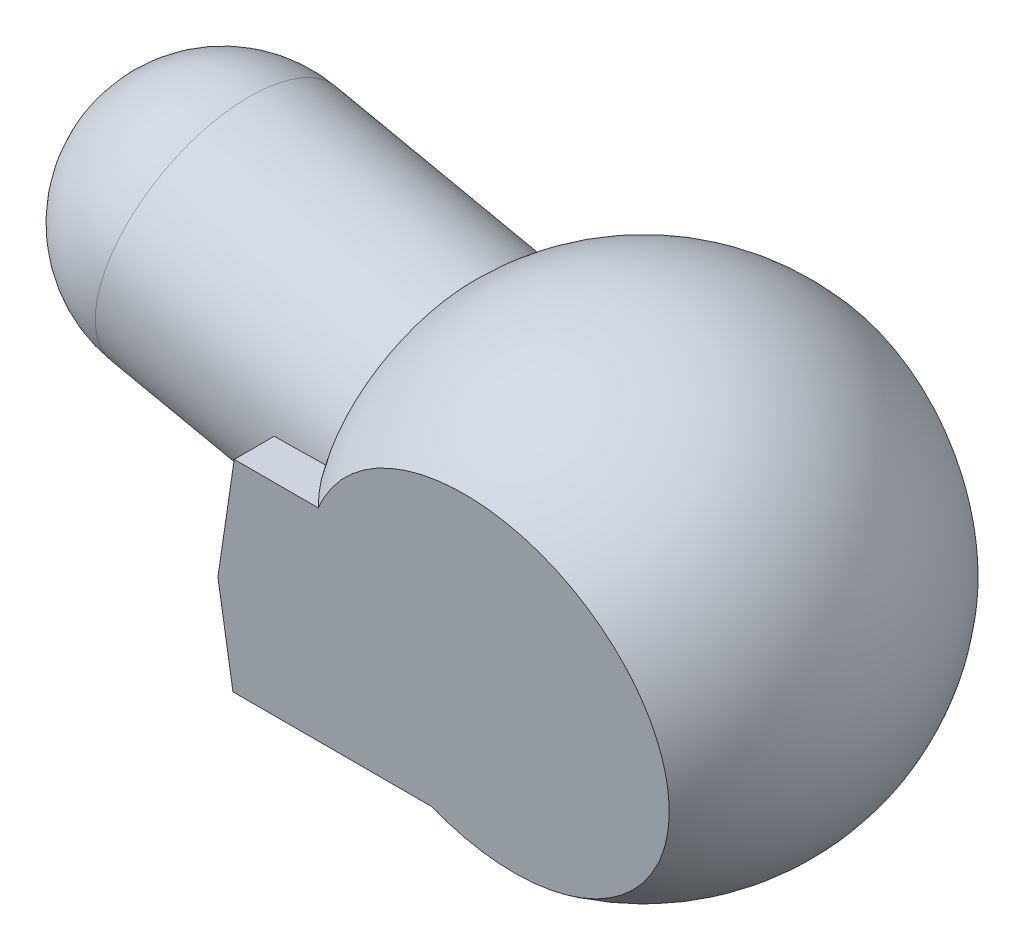
ISO-10303-21;
HEADER;
FILE_DESCRIPTION(('STEP AP214'),'2;1');
FILE_NAME('part.step','',(''),(''),'','','');
FILE_SCHEMA(('AUTOMOTIVE_DESIGN { 1 0 10303 214 1 1 1 1 }'));
ENDSEC;
DATA;
#1=APPLICATION_CONTEXT('core data for automotive mechanical design processes');
#2=APPLICATION_PROTOCOL_DEFINITION('international standard','automotive_design',2000,#1);
#3=PRODUCT_CONTEXT('',#1,'mechanical');
#4=PRODUCT('Part','Part','',(#3));
#5=PRODUCT_RELATED_PRODUCT_CATEGORY('part','',(#4));
#6=PRODUCT_DEFINITION_FORMATION('','',#4);
#7=PRODUCT_DEFINITION_CONTEXT('part definition',#1,'design');
#8=PRODUCT_DEFINITION('design','',#6,#7);
#9=PRODUCT_DEFINITION_SHAPE('','',#8);
#10=(LENGTH_UNIT() NAMED_UNIT(*) SI_UNIT(.MILLI.,.METRE.));
#11=(NAMED_UNIT(*) PLANE_ANGLE_UNIT() SI_UNIT($,.RADIAN.));
#12=(NAMED_UNIT(*) SI_UNIT($,.STERADIAN.) SOLID_ANGLE_UNIT());
#13=UNCERTAINTY_MEASURE_WITH_UNIT(LENGTH_MEASURE(1.E-05),#10,'distance_accuracy_value','');
#14=(GEOMETRIC_REPRESENTATION_CONTEXT(3) GLOBAL_UNCERTAINTY_ASSIGNED_CONTEXT((#13)) GLOBAL_UNIT_ASSIGNED_CONTEXT((#10,
#11,#12)) REPRESENTATION_CONTEXT('',''));
#15=CARTESIAN_POINT('',(0.,0.,0.));
#16=DIRECTION('',(0.,0.,1.));
#17=DIRECTION('',(1.,0.,0.));
#18=AXIS2_PLACEMENT_3D('',#15,#16,#17);
#19=CARTESIAN_POINT('',(-127.,25.4,75.3842872801489));
#20=DIRECTION('',(0.,1.,0.));
#21=DIRECTION('',(0.,0.,1.));
#22=AXIS2_PLACEMENT_3D('',#19,#20,#21);
#23=PLANE('',#22);
#24=CARTESIAN_POINT('',(-119.497604780753,25.4,0.));
#25=DIRECTION('',(0.,1.,0.));
#26=DIRECTION('',(1.,0.,0.));
#27=AXIS2_PLACEMENT_3D('',#24,#25,#26);
#28=ELLIPSE('',#27,274.876317802127,57.15);
#29=CARTESIAN_POINT('',(-88.2280398022466,25.4,-56.779005738505));
#30=VERTEX_POINT('',#29);
#31=CARTESIAN_POINT('',(-111.346408178174,25.4,-57.1248666815656));
#32=VERTEX_POINT('',#31);
#33=EDGE_CURVE('E59',#30,#32,#28,.T.);
#34=ORIENTED_EDGE('',*,*,#33,.F.);
#35=CARTESIAN_POINT('',(0.,25.4,0.));
#36=DIRECTION('',(0.,1.,0.));
#37=DIRECTION('',(0.,0.,1.));
#38=AXIS2_PLACEMENT_3D('',#35,#36,#37);
#39=CIRCLE('',#38,104.9192189258);
#40=CARTESIAN_POINT('',(-72.9743224104478,25.4,-75.3842872801489));
#41=VERTEX_POINT('',#40);
#42=EDGE_CURVE('E199',#41,#30,#39,.T.);
#43=ORIENTED_EDGE('',*,*,#42,.F.);
#44=DIRECTION('',(1.,0.,0.));
#45=VECTOR('',#44,1.);
#46=CARTESIAN_POINT('',(-127.,25.4,-75.3842872801489));
#47=LINE('',#46,#45);
#48=CARTESIAN_POINT('',(-111.346408178174,25.4,-75.3842872801489));
#49=VERTEX_POINT('',#48);
#50=EDGE_CURVE('E188',#49,#41,#47,.T.);
#51=ORIENTED_EDGE('',*,*,#50,.F.);
#52=DIRECTION('',(0.,0.,1.));
#53=VECTOR('',#52,1.);
#54=CARTESIAN_POINT('',(-111.346408178174,25.4,75.3842872801489));
#55=LINE('',#54,#53);
#56=EDGE_CURVE('E212',#49,#32,#55,.T.);
#57=ORIENTED_EDGE('',*,*,#56,.T.);
#58=EDGE_LOOP('',(#34,#43,#51,#57));
#59=FACE_BOUND('',#58,.T.);
#60=ADVANCED_FACE('F36',(#59),#23,.T.);
#61=CARTESIAN_POINT('',(-127.,25.4,75.3842872801489));
#62=DIRECTION('',(0.,-0.139173100960066,0.99026806874157));
#63=DIRECTION('',(0.,-0.99026806874157,-0.139173100960066));
#64=AXIS2_PLACEMENT_3D('',#61,#62,#63);
#65=PLANE('',#64);
#66=DIRECTION('',(1.,0.,0.));
#67=VECTOR('',#66,1.);
#68=CARTESIAN_POINT('',(-127.,25.4,75.3842872801489));
#69=LINE('',#68,#67);
#70=CARTESIAN_POINT('',(-111.346408178174,25.4,75.3842872801489));
#71=VERTEX_POINT('',#70);
#72=CARTESIAN_POINT('',(-72.9743224104478,25.4,75.3842872801489));
#73=VERTEX_POINT('',#72);
#74=EDGE_CURVE('E184',#71,#73,#69,.T.);
#75=ORIENTED_EDGE('',*,*,#74,.F.);
#76=DIRECTION('',(-0.256466671058071,-0.957146646836786,-0.134518188679037));
#77=VECTOR('',#76,1.);
#78=CARTESIAN_POINT('',(-112.376025580946,21.5574155404979,74.844247252796));
#79=LINE('',#78,#77);
#80=CARTESIAN_POINT('',(-127.,-33.0200000000007,67.173891716835));
#81=VERTEX_POINT('',#80);
#82=EDGE_CURVE('E214',#71,#81,#79,.T.);
#83=ORIENTED_EDGE('',*,*,#82,.T.);
#84=DIRECTION('',(0.,-0.99026806874157,-0.139173100960066));
#85=VECTOR('',#84,1.);
#86=CARTESIAN_POINT('',(-127.,25.4,75.3842872801489));
#87=LINE('',#86,#85);
#88=CARTESIAN_POINT('',(-127.,-81.7523967538567,60.325));
#89=VERTEX_POINT('',#88);
#90=EDGE_CURVE('E175',#81,#89,#87,.T.);
#91=ORIENTED_EDGE('',*,*,#90,.T.);
#92=DIRECTION('',(1.,0.,0.));
#93=VECTOR('',#92,1.);
#94=CARTESIAN_POINT('',(-127.,-81.7523967538567,60.325));
#95=LINE('',#94,#93);
#96=CARTESIAN_POINT('',(-36.4779728055165,-81.7523967538567,60.325));
#97=VERTEX_POINT('',#96);
#98=EDGE_CURVE('E183',#89,#97,#95,.T.);
#99=ORIENTED_EDGE('',*,*,#98,.T.);
#100=CARTESIAN_POINT('',(0.,-9.8973863464413,70.4235631402072));
#101=DIRECTION('',(0.,0.139173100960066,-0.99026806874157));
#102=DIRECTION('',(0.,0.99026806874157,0.139173100960066));
#103=AXIS2_PLACEMENT_3D('',#100,#101,#102);
#104=CIRCLE('',#103,81.2143213857416);
#105=EDGE_CURVE('E140',#73,#97,#104,.T.);
#106=ORIENTED_EDGE('',*,*,#105,.F.);
#107=EDGE_LOOP('',(#75,#83,#91,#99,#106));
#108=FACE_BOUND('',#107,.T.);
#109=ADVANCED_FACE('F240',(#108),#65,.T.);
#110=CARTESIAN_POINT('',(-111.346408178174,25.4,57.1248666815657));
#111=VERTEX_POINT('',#110);
#112=CARTESIAN_POINT('',(-88.2280398022466,25.4,56.779005738505));
#113=VERTEX_POINT('',#112);
#114=EDGE_CURVE('E144',#111,#113,#28,.T.);
#115=ORIENTED_EDGE('',*,*,#114,.F.);
#116=EDGE_CURVE('E211',#111,#71,#55,.T.);
#117=ORIENTED_EDGE('',*,*,#116,.T.);
#118=ORIENTED_EDGE('',*,*,#74,.T.);
#119=EDGE_CURVE('E198',#113,#73,#39,.T.);
#120=ORIENTED_EDGE('',*,*,#119,.F.);
#121=EDGE_LOOP('',(#115,#117,#118,#120));
#122=FACE_BOUND('',#121,.T.);
#123=ADVANCED_FACE('F229',(#122),#23,.T.);
#124=CARTESIAN_POINT('',(-127.,25.4,-75.3842872801489));
#125=DIRECTION('',(0.,-0.139173100960066,-0.99026806874157));
#126=DIRECTION('',(0.,0.99026806874157,-0.139173100960066));
#127=AXIS2_PLACEMENT_3D('',#124,#125,#126);
#128=PLANE('',#127);
#129=DIRECTION('',(0.,0.99026806874157,-0.139173100960066));
#130=VECTOR('',#129,1.);
#131=CARTESIAN_POINT('',(-127.,25.4,-75.3842872801489));
#132=LINE('',#131,#130);
#133=CARTESIAN_POINT('',(-127.,-81.7523967538567,-60.325));
#134=VERTEX_POINT('',#133);
#135=CARTESIAN_POINT('',(-127.,-33.0200000000007,-67.173891716835));
#136=VERTEX_POINT('',#135);
#137=EDGE_CURVE('E180',#134,#136,#132,.T.);
#138=ORIENTED_EDGE('',*,*,#137,.T.);
#139=DIRECTION('',(0.256466671058071,0.957146646836786,-0.134518188679037));
#140=VECTOR('',#139,1.);
#141=CARTESIAN_POINT('',(-112.376025580946,21.5574155404979,-74.844247252796));
#142=LINE('',#141,#140);
#143=EDGE_CURVE('E44',#136,#49,#142,.T.);
#144=ORIENTED_EDGE('',*,*,#143,.T.);
#145=ORIENTED_EDGE('',*,*,#50,.T.);
#146=CARTESIAN_POINT('',(0.,-9.8973863464413,-70.4235631402072));
#147=DIRECTION('',(0.,0.139173100960066,0.99026806874157));
#148=DIRECTION('',(0.,-0.99026806874157,0.139173100960066));
#149=AXIS2_PLACEMENT_3D('',#146,#147,#148);
#150=CIRCLE('',#149,81.2143213857416);
#151=CARTESIAN_POINT('',(-36.4779728055165,-81.7523967538567,-60.325));
#152=VERTEX_POINT('',#151);
#153=EDGE_CURVE('E138',#152,#41,#150,.T.);
#154=ORIENTED_EDGE('',*,*,#153,.F.);
#155=DIRECTION('',(1.,0.,0.));
#156=VECTOR('',#155,1.);
#157=CARTESIAN_POINT('',(-127.,-81.7523967538567,-60.325));
#158=LINE('',#157,#156);
#159=EDGE_CURVE('E191',#134,#152,#158,.T.);
#160=ORIENTED_EDGE('',*,*,#159,.F.);
#161=EDGE_LOOP('',(#138,#144,#145,#154,#160));
#162=FACE_BOUND('',#161,.T.);
#163=ADVANCED_FACE('F220',(#162),#128,.T.);
#164=CARTESIAN_POINT('',(-127.,0.,0.));
#165=DIRECTION('',(1.,0.,0.));
#166=DIRECTION('',(0.,0.,-1.));
#167=AXIS2_PLACEMENT_3D('',#164,#165,#166);
#168=CYLINDRICAL_SURFACE('',#167,101.6);
#169=DIRECTION('',(1.,0.,0.));
#170=VECTOR('',#169,1.);
#171=CARTESIAN_POINT('',(-127.,-100.803124951561,-12.7));
#172=LINE('',#171,#170);
#173=CARTESIAN_POINT('',(-50.8,-100.803124951561,-12.7));
#174=VERTEX_POINT('',#173);
#175=CARTESIAN_POINT('',(-36.4779728055165,-100.803124951561,-12.7));
#176=VERTEX_POINT('',#175);
#177=EDGE_CURVE('E172',#174,#176,#172,.T.);
#178=ORIENTED_EDGE('',*,*,#177,.F.);
#179=CARTESIAN_POINT('',(-50.8,0.,0.));
#180=DIRECTION('',(-1.,0.,0.));
#181=DIRECTION('',(0.,0.,1.));
#182=AXIS2_PLACEMENT_3D('',#179,#180,#181);
#183=CIRCLE('',#182,101.6);
#184=CARTESIAN_POINT('',(-50.8,-100.803124951561,12.7));
#185=VERTEX_POINT('',#184);
#186=EDGE_CURVE('E208',#185,#174,#183,.F.);
#187=ORIENTED_EDGE('',*,*,#186,.F.);
#188=DIRECTION('',(1.,0.,0.));
#189=VECTOR('',#188,1.);
#190=CARTESIAN_POINT('',(-127.,-100.803124951561,12.7));
#191=LINE('',#190,#189);
#192=CARTESIAN_POINT('',(-36.4779728055165,-100.803124951561,12.7));
#193=VERTEX_POINT('',#192);
#194=EDGE_CURVE('E167',#185,#193,#191,.T.);
#195=ORIENTED_EDGE('',*,*,#194,.T.);
#196=CARTESIAN_POINT('',(-36.4779728055165,0.,0.));
#197=DIRECTION('',(1.,0.,0.));
#198=DIRECTION('',(0.,0.,-1.));
#199=AXIS2_PLACEMENT_3D('',#196,#197,#198);
#200=CIRCLE('',#199,101.6);
#201=EDGE_CURVE('E196',#97,#193,#200,.T.);
#202=ORIENTED_EDGE('',*,*,#201,.F.);
#203=ORIENTED_EDGE('',*,*,#98,.F.);
#204=CARTESIAN_POINT('',(-127.,0.,0.));
#205=DIRECTION('',(1.,0.,0.));
#206=DIRECTION('',(0.,0.,-1.));
#207=AXIS2_PLACEMENT_3D('',#204,#205,#206);
#208=CIRCLE('',#207,101.6);
#209=EDGE_CURVE('E177',#89,#134,#208,.T.);
#210=ORIENTED_EDGE('',*,*,#209,.T.);
#211=ORIENTED_EDGE('',*,*,#159,.T.);
#212=EDGE_CURVE('E187',#176,#152,#200,.T.);
#213=ORIENTED_EDGE('',*,*,#212,.F.);
#214=EDGE_LOOP('',(#178,#187,#195,#202,#203,#210,#211,#213));
#215=FACE_BOUND('',#214,.T.);
#216=ADVANCED_FACE('F237',(#215),#168,.T.);
#217=CARTESIAN_POINT('',(-127.,0.,0.));
#218=DIRECTION('',(1.,0.,0.));
#219=DIRECTION('',(0.,0.,-1.));
#220=AXIS2_PLACEMENT_3D('',#217,#218,#219);
#221=PLANE('',#220);
#222=ORIENTED_EDGE('',*,*,#90,.F.);
#223=DIRECTION('',(0.,0.,-1.));
#224=VECTOR('',#223,1.);
#225=CARTESIAN_POINT('',(-127.,-33.0200000000007,-75.3842872801489));
#226=LINE('',#225,#224);
#227=EDGE_CURVE('E216',#81,#136,#226,.T.);
#228=ORIENTED_EDGE('',*,*,#227,.T.);
#229=ORIENTED_EDGE('',*,*,#137,.F.);
#230=ORIENTED_EDGE('',*,*,#209,.F.);
#231=EDGE_LOOP('',(#222,#228,#229,#230));
#232=FACE_BOUND('',#231,.T.);
#233=ADVANCED_FACE('F243',(#232),#221,.F.);
#234=CARTESIAN_POINT('',(0.,0.,0.));
#235=DIRECTION('',(-1.,0.,0.));
#236=DIRECTION('',(0.,1.,0.));
#237=AXIS2_PLACEMENT_3D('',#234,#235,#236);
#238=SPHERICAL_SURFACE('',#237,107.95);
#239=ORIENTED_EDGE('',*,*,#212,.T.);
#240=ORIENTED_EDGE('',*,*,#153,.T.);
#241=ORIENTED_EDGE('',*,*,#42,.T.);
#242=CARTESIAN_POINT('',(-89.5797377672125,19.0407610551009,0.));
#243=DIRECTION('',(0.978147600733806,-0.20791169081776,0.));
#244=DIRECTION('',(0.20791169081776,0.978147600733806,0.));
#245=AXIS2_PLACEMENT_3D('',#242,#243,#244);
#246=CIRCLE('',#245,57.15);
#247=EDGE_CURVE('E51',#30,#113,#246,.T.);
#248=ORIENTED_EDGE('',*,*,#247,.T.);
#249=ORIENTED_EDGE('',*,*,#119,.T.);
#250=ORIENTED_EDGE('',*,*,#105,.T.);
#251=ORIENTED_EDGE('',*,*,#201,.T.);
#252=CARTESIAN_POINT('',(0.,0.,12.7));
#253=DIRECTION('',(0.,0.,-1.));
#254=DIRECTION('',(-1.,0.,0.));
#255=AXIS2_PLACEMENT_3D('',#252,#253,#254);
#256=CIRCLE('',#255,107.200338152452);
#257=CARTESIAN_POINT('',(-3.17122908317451,-107.153421812381,12.7));
#258=VERTEX_POINT('',#257);
#259=EDGE_CURVE('E201',#258,#193,#256,.T.);
#260=ORIENTED_EDGE('',*,*,#259,.F.);
#261=CARTESIAN_POINT('',(50.292,-67.056,0.));
#262=DIRECTION('',(0.6,-0.8,0.));
#263=DIRECTION('',(0.8,0.6,0.));
#264=AXIS2_PLACEMENT_3D('',#261,#262,#263);
#265=CIRCLE('',#264,68.0250696434777);
#266=CARTESIAN_POINT('',(-3.17122908317453,-107.153421812381,-12.7));
#267=VERTEX_POINT('',#266);
#268=EDGE_CURVE('E204',#258,#267,#265,.T.);
#269=ORIENTED_EDGE('',*,*,#268,.T.);
#270=CARTESIAN_POINT('',(0.,0.,-12.7));
#271=DIRECTION('',(0.,0.,-1.));
#272=DIRECTION('',(-1.,0.,0.));
#273=AXIS2_PLACEMENT_3D('',#270,#271,#272);
#274=CIRCLE('',#273,107.200338152452);
#275=EDGE_CURVE('E206',#267,#176,#274,.T.);
#276=ORIENTED_EDGE('',*,*,#275,.T.);
#277=EDGE_LOOP('',(#239,#240,#241,#248,#249,#250,#251,#260,#269,#276));
#278=FACE_BOUND('',#277,.T.);
#279=ADVANCED_FACE('F232',(#278),#238,.T.);
#280=CARTESIAN_POINT('',(12.7,-95.25,-12.7));
#281=DIRECTION('',(0.6,-0.8,0.));
#282=DIRECTION('',(0.8,0.6,0.));
#283=AXIS2_PLACEMENT_3D('',#280,#281,#282);
#284=PLANE('',#283);
#285=ORIENTED_EDGE('',*,*,#268,.F.);
#286=DIRECTION('',(0.8,0.6,0.));
#287=VECTOR('',#286,1.);
#288=CARTESIAN_POINT('',(12.7,-95.25,12.7));
#289=LINE('',#288,#287);
#290=CARTESIAN_POINT('',(-35.56,-131.445,12.7));
#291=VERTEX_POINT('',#290);
#292=EDGE_CURVE('E152',#291,#258,#289,.T.);
#293=ORIENTED_EDGE('',*,*,#292,.F.);
#294=DIRECTION('',(0.,0.,1.));
#295=VECTOR('',#294,1.);
#296=CARTESIAN_POINT('',(-35.56,-131.445,-12.7));
#297=LINE('',#296,#295);
#298=CARTESIAN_POINT('',(-35.56,-131.445,-12.7));
#299=VERTEX_POINT('',#298);
#300=EDGE_CURVE('E165',#299,#291,#297,.T.);
#301=ORIENTED_EDGE('',*,*,#300,.F.);
#302=DIRECTION('',(0.8,0.6,0.));
#303=VECTOR('',#302,1.);
#304=CARTESIAN_POINT('',(12.7,-95.25,-12.7));
#305=LINE('',#304,#303);
#306=EDGE_CURVE('E155',#299,#267,#305,.T.);
#307=ORIENTED_EDGE('',*,*,#306,.T.);
#308=EDGE_LOOP('',(#285,#293,#301,#307));
#309=FACE_BOUND('',#308,.T.);
#310=ADVANCED_FACE('F253',(#309),#284,.T.);
#311=CARTESIAN_POINT('',(-41.275,-123.825,-12.7));
#312=DIRECTION('',(0.,0.,1.));
#313=DIRECTION('',(1.,0.,0.));
#314=AXIS2_PLACEMENT_3D('',#311,#312,#313);
#315=CYLINDRICAL_SURFACE('',#314,9.525);
#316=CARTESIAN_POINT('',(-41.275,-123.825,12.7));
#317=DIRECTION('',(0.,0.,1.));
#318=DIRECTION('',(-1.,0.,0.));
#319=AXIS2_PLACEMENT_3D('',#316,#317,#318);
#320=CIRCLE('',#319,9.525);
#321=CARTESIAN_POINT('',(-50.8,-123.825,12.7));
#322=VERTEX_POINT('',#321);
#323=EDGE_CURVE('E160',#322,#291,#320,.T.);
#324=ORIENTED_EDGE('',*,*,#323,.F.);
#325=DIRECTION('',(0.,0.,1.));
#326=VECTOR('',#325,1.);
#327=CARTESIAN_POINT('',(-50.8,-123.825,-12.7));
#328=LINE('',#327,#326);
#329=CARTESIAN_POINT('',(-50.8,-123.825,-12.7));
#330=VERTEX_POINT('',#329);
#331=EDGE_CURVE('E158',#330,#322,#328,.T.);
#332=ORIENTED_EDGE('',*,*,#331,.F.);
#333=CARTESIAN_POINT('',(-41.275,-123.825,-12.7));
#334=DIRECTION('',(0.,0.,1.));
#335=DIRECTION('',(-1.,0.,0.));
#336=AXIS2_PLACEMENT_3D('',#333,#334,#335);
#337=CIRCLE('',#336,9.525);
#338=EDGE_CURVE('E151',#330,#299,#337,.T.);
#339=ORIENTED_EDGE('',*,*,#338,.T.);
#340=ORIENTED_EDGE('',*,*,#300,.T.);
#341=EDGE_LOOP('',(#324,#332,#339,#340));
#342=FACE_BOUND('',#341,.T.);
#343=ADVANCED_FACE('F258',(#342),#315,.T.);
#344=CARTESIAN_POINT('',(-50.8,-123.825,-12.7));
#345=DIRECTION('',(-1.,0.,0.));
#346=DIRECTION('',(0.,0.,1.));
#347=AXIS2_PLACEMENT_3D('',#344,#345,#346);
#348=PLANE('',#347);
#349=DIRECTION('',(0.,-1.,0.));
#350=VECTOR('',#349,1.);
#351=CARTESIAN_POINT('',(-50.8,-123.825,12.7));
#352=LINE('',#351,#350);
#353=EDGE_CURVE('E148',#185,#322,#352,.T.);
#354=ORIENTED_EDGE('',*,*,#353,.F.);
#355=ORIENTED_EDGE('',*,*,#186,.T.);
#356=DIRECTION('',(0.,-1.,0.));
#357=VECTOR('',#356,1.);
#358=CARTESIAN_POINT('',(-50.8,-123.825,-12.7));
#359=LINE('',#358,#357);
#360=EDGE_CURVE('E149',#174,#330,#359,.T.);
#361=ORIENTED_EDGE('',*,*,#360,.T.);
#362=ORIENTED_EDGE('',*,*,#331,.T.);
#363=EDGE_LOOP('',(#354,#355,#361,#362));
#364=FACE_BOUND('',#363,.T.);
#365=ADVANCED_FACE('F261',(#364),#348,.T.);
#366=CARTESIAN_POINT('',(-41.275,-123.825,-12.7));
#367=DIRECTION('',(0.,0.,-1.));
#368=DIRECTION('',(-1.,0.,0.));
#369=AXIS2_PLACEMENT_3D('',#366,#367,#368);
#370=PLANE('',#369);
#371=ORIENTED_EDGE('',*,*,#360,.F.);
#372=ORIENTED_EDGE('',*,*,#177,.T.);
#373=ORIENTED_EDGE('',*,*,#275,.F.);
#374=ORIENTED_EDGE('',*,*,#306,.F.);
#375=ORIENTED_EDGE('',*,*,#338,.F.);
#376=EDGE_LOOP('',(#371,#372,#373,#374,#375));
#377=FACE_BOUND('',#376,.T.);
#378=ADVANCED_FACE('F250',(#377),#370,.T.);
#379=CARTESIAN_POINT('',(-41.275,-123.825,12.7));
#380=DIRECTION('',(0.,0.,-1.));
#381=DIRECTION('',(-1.,0.,0.));
#382=AXIS2_PLACEMENT_3D('',#379,#380,#381);
#383=PLANE('',#382);
#384=ORIENTED_EDGE('',*,*,#194,.F.);
#385=ORIENTED_EDGE('',*,*,#353,.T.);
#386=ORIENTED_EDGE('',*,*,#323,.T.);
#387=ORIENTED_EDGE('',*,*,#292,.T.);
#388=ORIENTED_EDGE('',*,*,#259,.T.);
#389=EDGE_LOOP('',(#384,#385,#386,#387,#388));
#390=FACE_BOUND('',#389,.T.);
#391=ADVANCED_FACE('F263',(#390),#383,.F.);
#392=CARTESIAN_POINT('',(-111.346408178174,25.4,75.3842872801489));
#393=DIRECTION('',(-0.965925826289069,0.258819045102518,0.));
#394=DIRECTION('',(-0.258819045102518,-0.965925826289069,0.));
#395=AXIS2_PLACEMENT_3D('',#392,#393,#394);
#396=PLANE('',#395);
#397=CARTESIAN_POINT('',(-111.785638286816,23.7607709183344,0.));
#398=DIRECTION('',(-0.965925826289069,0.258819045102518,0.));
#399=DIRECTION('',(0.258819045102518,0.965925826289069,0.));
#400=AXIS2_PLACEMENT_3D('',#397,#398,#399);
#401=ELLIPSE('',#400,57.2284295737812,57.15);
#402=EDGE_CURVE('E11',#32,#111,#401,.T.);
#403=ORIENTED_EDGE('',*,*,#402,.F.);
#404=ORIENTED_EDGE('',*,*,#56,.F.);
#405=ORIENTED_EDGE('',*,*,#143,.F.);
#406=ORIENTED_EDGE('',*,*,#227,.F.);
#407=ORIENTED_EDGE('',*,*,#82,.F.);
#408=ORIENTED_EDGE('',*,*,#116,.F.);
#409=EDGE_LOOP('',(#403,#404,#405,#406,#407,#408));
#410=FACE_BOUND('',#409,.T.);
#411=ADVANCED_FACE('F38',(#410),#396,.T.);
#412=CARTESIAN_POINT('',(0.,0.,0.));
#413=DIRECTION('',(0.978147600733806,-0.20791169081776,0.));
#414=DIRECTION('',(0.20791169081776,0.978147600733806,0.));
#415=AXIS2_PLACEMENT_3D('',#412,#413,#414);
#416=CYLINDRICAL_SURFACE('',#415,57.15);
#417=CARTESIAN_POINT('',(-191.765837123863,40.7610869848218,0.));
#418=DIRECTION('',(0.978147600733806,-0.207911690817759,0.));
#419=DIRECTION('',(0.207911690817759,0.978147600733806,0.));
#420=AXIS2_PLACEMENT_3D('',#417,#418,#419);
#421=CIRCLE('',#420,57.15);
#422=CARTESIAN_POINT('',(-179.883683993628,96.6622223667588,0.));
#423=VERTEX_POINT('',#422);
#424=EDGE_CURVE('E136',#423,#423,#421,.T.);
#425=ORIENTED_EDGE('',*,*,#424,.T.);
#426=EDGE_LOOP('',(#425));
#427=FACE_BOUND('',#426,.T.);
#428=ORIENTED_EDGE('',*,*,#247,.F.);
#429=ORIENTED_EDGE('',*,*,#33,.T.);
#430=ORIENTED_EDGE('',*,*,#402,.T.);
#431=ORIENTED_EDGE('',*,*,#114,.T.);
#432=EDGE_LOOP('',(#428,#429,#430,#431));
#433=FACE_BOUND('',#432,.T.);
#434=ADVANCED_FACE('F132',(#427,#433),#416,.T.);
#435=CARTESIAN_POINT('',(-191.765837123863,40.7610869848218,0.));
#436=DIRECTION('',(0.978147600733806,-0.207911690817759,0.));
#437=DIRECTION('',(0.207911690817759,0.978147600733806,0.));
#438=AXIS2_PLACEMENT_3D('',#435,#436,#437);
#439=SPHERICAL_SURFACE('',#438,57.15);
#440=CARTESIAN_POINT('',(-247.6669725058,52.6432401150568,0.));
#441=VERTEX_POINT('',#440);
#442=VERTEX_LOOP('',#441);
#443=FACE_BOUND('',#442,.T.);
#444=ORIENTED_EDGE('',*,*,#424,.F.);
#445=EDGE_LOOP('',(#444));
#446=FACE_BOUND('',#445,.T.);
#447=ADVANCED_FACE('F129',(#443,#446),#439,.T.);
#448=CLOSED_SHELL('',(#60,#109,#123,#163,#216,#233,#279,#310,#343,#365,#378,#391,#411,#434,#447));
#449=MANIFOLD_SOLID_BREP('B2',#448);
#450=ADVANCED_BREP_SHAPE_REPRESENTATION('',(#18,#449),#14);
#451=SHAPE_DEFINITION_REPRESENTATION(#9,#450);
ENDSEC;
END-ISO-10303-21;
